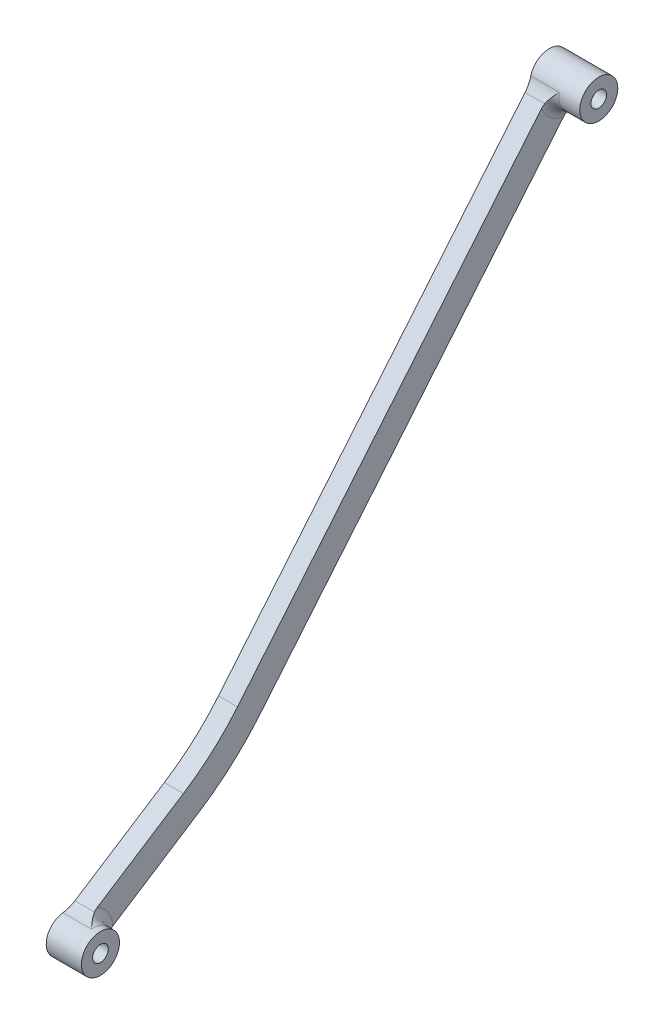
ISO-10303-21;
HEADER;
FILE_DESCRIPTION(('STEP AP214'),'2;1');
FILE_NAME('part.step','',(''),(''),'','','');
FILE_SCHEMA(('AUTOMOTIVE_DESIGN { 1 0 10303 214 1 1 1 1 }'));
ENDSEC;
DATA;
#1=APPLICATION_CONTEXT('core data for automotive mechanical design processes');
#2=APPLICATION_PROTOCOL_DEFINITION('international standard','automotive_design',2000,#1);
#3=PRODUCT_CONTEXT('',#1,'mechanical');
#4=PRODUCT('Part','Part','',(#3));
#5=PRODUCT_RELATED_PRODUCT_CATEGORY('part','',(#4));
#6=PRODUCT_DEFINITION_FORMATION('','',#4);
#7=PRODUCT_DEFINITION_CONTEXT('part definition',#1,'design');
#8=PRODUCT_DEFINITION('design','',#6,#7);
#9=PRODUCT_DEFINITION_SHAPE('','',#8);
#10=(LENGTH_UNIT() NAMED_UNIT(*) SI_UNIT(.MILLI.,.METRE.));
#11=(NAMED_UNIT(*) PLANE_ANGLE_UNIT() SI_UNIT($,.RADIAN.));
#12=(NAMED_UNIT(*) SI_UNIT($,.STERADIAN.) SOLID_ANGLE_UNIT());
#13=UNCERTAINTY_MEASURE_WITH_UNIT(LENGTH_MEASURE(1.E-05),#10,'distance_accuracy_value','');
#14=(GEOMETRIC_REPRESENTATION_CONTEXT(3) GLOBAL_UNCERTAINTY_ASSIGNED_CONTEXT((#13)) GLOBAL_UNIT_ASSIGNED_CONTEXT((#10,
#11,#12)) REPRESENTATION_CONTEXT('',''));
#15=CARTESIAN_POINT('',(0.,0.,0.));
#16=DIRECTION('',(0.,0.,1.));
#17=DIRECTION('',(1.,0.,0.));
#18=AXIS2_PLACEMENT_3D('',#15,#16,#17);
#19=CARTESIAN_POINT('',(-10.4,4.78302883585792,1.33314402376694));
#20=DIRECTION('',(1.,0.,0.));
#21=DIRECTION('',(0.,0.,-1.));
#22=AXIS2_PLACEMENT_3D('',#19,#20,#21);
#23=PLANE('',#22);
#24=DIRECTION('',(0.,0.769433939697813,-0.638726398735095));
#25=VECTOR('',#24,1.);
#26=CARTESIAN_POINT('',(-10.4,47.9582816977153,-107.288492562416));
#27=LINE('',#26,#25);
#28=CARTESIAN_POINT('',(-10.4,-30.9856494933073,-41.7551565993106));
#29=VERTEX_POINT('',#28);
#30=CARTESIAN_POINT('',(-10.4,45.9959165225748,-105.659484045047));
#31=VERTEX_POINT('',#30);
#32=EDGE_CURVE('E152',#29,#31,#27,.T.);
#33=ORIENTED_EDGE('',*,*,#32,.T.);
#34=CARTESIAN_POINT('',(-10.4,51.9101917486536,-106.670101950188));
#35=DIRECTION('',(1.,0.,0.));
#36=DIRECTION('',(0.,0.,-1.));
#37=AXIS2_PLACEMENT_3D('',#34,#35,#36);
#38=CIRCLE('',#37,6.);
#39=CARTESIAN_POINT('',(-10.4,49.8282749149854,-101.04288040686));
#40=VERTEX_POINT('',#39);
#41=EDGE_CURVE('E213',#31,#40,#38,.F.);
#42=ORIENTED_EDGE('',*,*,#41,.T.);
#43=DIRECTION('',(0.,-0.769433939697813,0.638726398735094));
#44=VECTOR('',#43,1.);
#45=CARTESIAN_POINT('',(-10.4,-27.1532911008968,-37.1385529611237));
#46=LINE('',#45,#44);
#47=CARTESIAN_POINT('',(-10.4,-27.1532911008968,-37.1385529611237));
#48=VERTEX_POINT('',#47);
#49=EDGE_CURVE('E150',#40,#48,#46,.T.);
#50=ORIENTED_EDGE('',*,*,#49,.T.);
#51=CARTESIAN_POINT('',(-10.4,4.78302883585792,1.33314402376694));
#52=DIRECTION('',(-1.,0.,0.));
#53=DIRECTION('',(0.,0.,-1.));
#54=AXIS2_PLACEMENT_3D('',#51,#52,#53);
#55=CIRCLE('',#54,50.);
#56=CARTESIAN_POINT('',(-10.4,-37.2377094525441,-25.7640431678519));
#57=VERTEX_POINT('',#56);
#58=EDGE_CURVE('E172',#48,#57,#55,.T.);
#59=ORIENTED_EDGE('',*,*,#58,.T.);
#60=DIRECTION('',(0.,-0.541943743832376,0.840414765768039));
#61=VECTOR('',#60,1.);
#62=CARTESIAN_POINT('',(-10.4,-50.2863804140003,-5.52892490242477));
#63=LINE('',#62,#61);
#64=CARTESIAN_POINT('',(-10.4,-48.9042064872828,-7.67231965527997));
#65=VERTEX_POINT('',#64);
#66=EDGE_CURVE('E128',#57,#65,#63,.T.);
#67=ORIENTED_EDGE('',*,*,#66,.T.);
#68=CARTESIAN_POINT('',(-10.4,-54.2414730820722,-4.93122766555308));
#69=DIRECTION('',(1.,0.,0.));
#70=DIRECTION('',(0.,0.,-1.));
#71=AXIS2_PLACEMENT_3D('',#68,#69,#70);
#72=CIRCLE('',#71,6.);
#73=CARTESIAN_POINT('',(-10.4,-53.946695081891,-10.9239821182742));
#74=VERTEX_POINT('',#73);
#75=EDGE_CURVE('E211',#65,#74,#72,.F.);
#76=ORIENTED_EDGE('',*,*,#75,.T.);
#77=DIRECTION('',(0.,0.541943743832377,-0.840414765768038));
#78=VECTOR('',#77,1.);
#79=CARTESIAN_POINT('',(-10.4,-55.3288690086085,-8.78058736541904));
#80=LINE('',#79,#78);
#81=CARTESIAN_POINT('',(-10.4,-42.2801980471522,-29.0157056308461));
#82=VERTEX_POINT('',#81);
#83=EDGE_CURVE('E175',#74,#82,#80,.T.);
#84=ORIENTED_EDGE('',*,*,#83,.T.);
#85=CARTESIAN_POINT('',(-10.4,4.78302883585792,1.33314402376694));
#86=DIRECTION('',(1.,0.,0.));
#87=DIRECTION('',(0.,0.,-1.));
#88=AXIS2_PLACEMENT_3D('',#85,#86,#87);
#89=CIRCLE('',#88,56.);
#90=EDGE_CURVE('E177',#82,#29,#89,.T.);
#91=ORIENTED_EDGE('',*,*,#90,.T.);
#92=EDGE_LOOP('',(#33,#42,#50,#59,#67,#76,#84,#91));
#93=FACE_BOUND('',#92,.T.);
#94=ADVANCED_FACE('F17',(#93),#23,.T.);
#95=CARTESIAN_POINT('',(-14.4,4.78302883585792,1.33314402376694));
#96=DIRECTION('',(1.,0.,0.));
#97=DIRECTION('',(0.,0.,-1.));
#98=AXIS2_PLACEMENT_3D('',#95,#96,#97);
#99=CYLINDRICAL_SURFACE('',#98,50.);
#100=ORIENTED_EDGE('',*,*,#58,.F.);
#101=DIRECTION('',(1.,0.,0.));
#102=VECTOR('',#101,1.);
#103=CARTESIAN_POINT('',(-14.4,-27.1532911008968,-37.1385529611237));
#104=LINE('',#103,#102);
#105=CARTESIAN_POINT('',(-14.4,-27.1532911008968,-37.1385529611237));
#106=VERTEX_POINT('',#105);
#107=EDGE_CURVE('E149',#106,#48,#104,.T.);
#108=ORIENTED_EDGE('',*,*,#107,.F.);
#109=CARTESIAN_POINT('',(-14.4,4.78302883585792,1.33314402376694));
#110=DIRECTION('',(-1.,0.,0.));
#111=DIRECTION('',(0.,0.,-1.));
#112=AXIS2_PLACEMENT_3D('',#109,#110,#111);
#113=CIRCLE('',#112,50.);
#114=CARTESIAN_POINT('',(-14.4,-37.2377094525441,-25.7640431678519));
#115=VERTEX_POINT('',#114);
#116=EDGE_CURVE('E140',#106,#115,#113,.T.);
#117=ORIENTED_EDGE('',*,*,#116,.T.);
#118=DIRECTION('',(1.,0.,0.));
#119=VECTOR('',#118,1.);
#120=CARTESIAN_POINT('',(-14.4,-37.2377094525441,-25.7640431678519));
#121=LINE('',#120,#119);
#122=EDGE_CURVE('E123',#115,#57,#121,.T.);
#123=ORIENTED_EDGE('',*,*,#122,.T.);
#124=EDGE_LOOP('',(#100,#108,#117,#123));
#125=FACE_BOUND('',#124,.T.);
#126=ADVANCED_FACE('F147',(#125),#99,.F.);
#127=CARTESIAN_POINT('',(-14.4,-27.1532911008968,-37.1385529611237));
#128=DIRECTION('',(0.,0.638726398735094,0.769433939697813));
#129=DIRECTION('',(0.,-0.769433939697813,0.638726398735094));
#130=AXIS2_PLACEMENT_3D('',#127,#128,#129);
#131=PLANE('',#130);
#132=ORIENTED_EDGE('',*,*,#49,.F.);
#133=CARTESIAN_POINT('',(-10.4,49.8282749149854,-101.04288040686));
#134=CARTESIAN_POINT('',(-10.4000018780008,49.8829783343423,-101.088291086376));
#135=CARTESIAN_POINT('',(-10.3971571203399,49.9376712152212,-101.133693017638));
#136=CARTESIAN_POINT('',(-10.3859981831861,50.0464152362978,-101.223964155136));
#137=CARTESIAN_POINT('',(-10.3777150882286,50.1004682567761,-101.268834922241));
#138=CARTESIAN_POINT('',(-10.3559028720338,50.2079189928066,-101.358032471407));
#139=CARTESIAN_POINT('',(-10.3423756939953,50.2613169435432,-101.4023594487));
#140=CARTESIAN_POINT('',(-10.3101728421491,50.3675077018207,-101.490511058753));
#141=CARTESIAN_POINT('',(-10.2914682778259,50.4202953291346,-101.534331391276));
#142=CARTESIAN_POINT('',(-10.2703025064278,50.4724861579859,-101.577656306437));
#143=B_SPLINE_CURVE_WITH_KNOTS('',3,(#133,#134,#135,#136,#137,#138,#139,#140,#141,#142),
.UNSPECIFIED.,.F.,.F.,(4,2,2,2,4),(0.,0.21321041686945,0.425212649260076,0.637136399038094,
0.850267417765537),.UNSPECIFIED.);
#144=CARTESIAN_POINT('',(-10.2703025064279,50.4724861579859,-101.577656306437));
#145=VERTEX_POINT('',#144);
#146=EDGE_CURVE('E256',#40,#145,#143,.T.);
#147=ORIENTED_EDGE('',*,*,#146,.T.);
#148=DIRECTION('',(-1.,0.,0.));
#149=VECTOR('',#148,1.);
#150=CARTESIAN_POINT('',(-14.4,50.4724861579859,-101.577656306437));
#151=LINE('',#150,#149);
#152=CARTESIAN_POINT('',(-14.4,50.4724861579858,-101.577656306437));
#153=VERTEX_POINT('',#152);
#154=EDGE_CURVE('E199',#145,#153,#151,.T.);
#155=ORIENTED_EDGE('',*,*,#154,.T.);
#156=DIRECTION('',(0.,-0.769433939697813,0.638726398735094));
#157=VECTOR('',#156,1.);
#158=CARTESIAN_POINT('',(-14.4,-27.1532911008968,-37.1385529611237));
#159=LINE('',#158,#157);
#160=EDGE_CURVE('E134',#153,#106,#159,.T.);
#161=ORIENTED_EDGE('',*,*,#160,.T.);
#162=ORIENTED_EDGE('',*,*,#107,.T.);
#163=EDGE_LOOP('',(#132,#147,#155,#161,#162));
#164=FACE_BOUND('',#163,.T.);
#165=ADVANCED_FACE('F284',(#164),#131,.T.);
#166=CARTESIAN_POINT('',(-14.4,51.9101917486536,-106.670101950188));
#167=DIRECTION('',(1.,0.,0.));
#168=DIRECTION('',(0.,0.,-1.));
#169=AXIS2_PLACEMENT_3D('',#166,#167,#168);
#170=CYLINDRICAL_SURFACE('',#169,4.);
#171=CARTESIAN_POINT('',(-8.4,51.9101917486536,-106.670101950188));
#172=DIRECTION('',(1.,0.,0.));
#173=DIRECTION('',(0.,0.,-1.));
#174=AXIS2_PLACEMENT_3D('',#171,#172,#173);
#175=CIRCLE('',#174,4.);
#176=CARTESIAN_POINT('',(-8.4,52.8680528693507,-102.786482237413));
#177=VERTEX_POINT('',#176);
#178=CARTESIAN_POINT('',(-8.4,48.269222798458,-108.326406603237));
#179=VERTEX_POINT('',#178);
#180=EDGE_CURVE('E208',#177,#179,#175,.T.);
#181=ORIENTED_EDGE('',*,*,#180,.T.);
#182=DIRECTION('',(1.,0.,0.));
#183=VECTOR('',#182,1.);
#184=CARTESIAN_POINT('',(-14.4,48.269222798458,-108.326406603237));
#185=LINE('',#184,#183);
#186=CARTESIAN_POINT('',(-14.4,48.269222798458,-108.326406603237));
#187=VERTEX_POINT('',#186);
#188=EDGE_CURVE('E197',#179,#187,#185,.F.);
#189=ORIENTED_EDGE('',*,*,#188,.T.);
#190=CARTESIAN_POINT('',(-14.4,51.9101917486536,-106.670101950188));
#191=DIRECTION('',(1.,0.,0.));
#192=DIRECTION('',(0.,0.,1.));
#193=AXIS2_PLACEMENT_3D('',#190,#191,#192);
#194=CIRCLE('',#193,4.);
#195=CARTESIAN_POINT('',(-14.4,52.8680528693507,-102.786482237413));
#196=VERTEX_POINT('',#195);
#197=EDGE_CURVE('E168',#187,#196,#194,.T.);
#198=ORIENTED_EDGE('',*,*,#197,.T.);
#199=DIRECTION('',(1.,0.,0.));
#200=VECTOR('',#199,1.);
#201=CARTESIAN_POINT('',(-14.4,52.8680528693507,-102.786482237413));
#202=LINE('',#201,#200);
#203=EDGE_CURVE('E195',#196,#177,#202,.T.);
#204=ORIENTED_EDGE('',*,*,#203,.T.);
#205=EDGE_LOOP('',(#181,#189,#198,#204));
#206=FACE_BOUND('',#205,.T.);
#207=CARTESIAN_POINT('',(-4.,51.9101917486536,-106.670101950188));
#208=DIRECTION('',(-1.,0.,0.));
#209=DIRECTION('',(0.,0.,1.));
#210=AXIS2_PLACEMENT_3D('',#207,#208,#209);
#211=CIRCLE('',#210,4.);
#212=CARTESIAN_POINT('',(-4.,51.9101917486536,-102.670101950188));
#213=VERTEX_POINT('',#212);
#214=EDGE_CURVE('E434',#213,#213,#211,.T.);
#215=ORIENTED_EDGE('',*,*,#214,.T.);
#216=EDGE_LOOP('',(#215));
#217=FACE_BOUND('',#216,.T.);
#218=ADVANCED_FACE('F310',(#206,#217),#170,.T.);
#219=CARTESIAN_POINT('',(-14.4,47.9582816977153,-107.288492562416));
#220=DIRECTION('',(0.,-0.638726398735095,-0.769433939697813));
#221=DIRECTION('',(0.,0.769433939697813,-0.638726398735095));
#222=AXIS2_PLACEMENT_3D('',#219,#220,#221);
#223=PLANE('',#222);
#224=DIRECTION('',(0.,0.769433939697813,-0.638726398735095));
#225=VECTOR('',#224,1.);
#226=CARTESIAN_POINT('',(-14.4,47.9582816977153,-107.288492562416));
#227=LINE('',#226,#225);
#228=CARTESIAN_POINT('',(-14.4,-30.9856494933073,-41.7551565993106));
#229=VERTEX_POINT('',#228);
#230=CARTESIAN_POINT('',(-14.4,46.6401277655752,-106.194259944624));
#231=VERTEX_POINT('',#230);
#232=EDGE_CURVE('E165',#229,#231,#227,.T.);
#233=ORIENTED_EDGE('',*,*,#232,.T.);
#234=DIRECTION('',(-1.,0.,0.));
#235=VECTOR('',#234,1.);
#236=CARTESIAN_POINT('',(-10.4,46.6401277655752,-106.194259944624));
#237=LINE('',#236,#235);
#238=CARTESIAN_POINT('',(-10.2703025064279,46.6401277655752,-106.194259944624));
#239=VERTEX_POINT('',#238);
#240=EDGE_CURVE('E193',#231,#239,#237,.F.);
#241=ORIENTED_EDGE('',*,*,#240,.T.);
#242=CARTESIAN_POINT('',(-10.2703025064279,46.6401277655752,-106.194259944624));
#243=CARTESIAN_POINT('',(-10.291468277826,46.587936936724,-106.150935029463));
#244=CARTESIAN_POINT('',(-10.3101728421491,46.5351493094102,-106.10711469694));
#245=CARTESIAN_POINT('',(-10.3423756939953,46.4289585511326,-106.018963086887));
#246=CARTESIAN_POINT('',(-10.3559028720337,46.3755606003961,-105.974636109594));
#247=CARTESIAN_POINT('',(-10.3777150882286,46.2681098643656,-105.885438560428));
#248=CARTESIAN_POINT('',(-10.3859981831861,46.2140568438873,-105.840567793323));
#249=CARTESIAN_POINT('',(-10.3971571203398,46.1053128228107,-105.750296655825));
#250=CARTESIAN_POINT('',(-10.4000018780008,46.0506199419317,-105.704894724563));
#251=CARTESIAN_POINT('',(-10.4,45.9959165225748,-105.659484045047));
#252=B_SPLINE_CURVE_WITH_KNOTS('',3,(#242,#243,#244,#245,#246,#247,#248,#249,#250,#251),
.UNSPECIFIED.,.F.,.F.,(4,2,2,2,4),(0.,0.213131018727416,0.425054768505391,0.637057000896003,
0.850267417765426),.UNSPECIFIED.);
#253=EDGE_CURVE('E226',#239,#31,#252,.T.);
#254=ORIENTED_EDGE('',*,*,#253,.T.);
#255=ORIENTED_EDGE('',*,*,#32,.F.);
#256=DIRECTION('',(1.,0.,0.));
#257=VECTOR('',#256,1.);
#258=CARTESIAN_POINT('',(-14.4,-30.9856494933073,-41.7551565993106));
#259=LINE('',#258,#257);
#260=EDGE_CURVE('E184',#229,#29,#259,.T.);
#261=ORIENTED_EDGE('',*,*,#260,.F.);
#262=EDGE_LOOP('',(#233,#241,#254,#255,#261));
#263=FACE_BOUND('',#262,.T.);
#264=ADVANCED_FACE('F313',(#263),#223,.T.);
#265=CARTESIAN_POINT('',(-14.4,4.78302883585792,1.33314402376694));
#266=DIRECTION('',(1.,0.,0.));
#267=DIRECTION('',(0.,0.,-1.));
#268=AXIS2_PLACEMENT_3D('',#265,#266,#267);
#269=CYLINDRICAL_SURFACE('',#268,56.);
#270=ORIENTED_EDGE('',*,*,#90,.F.);
#271=DIRECTION('',(1.,0.,0.));
#272=VECTOR('',#271,1.);
#273=CARTESIAN_POINT('',(-14.4,-42.2801980471522,-29.0157056308461));
#274=LINE('',#273,#272);
#275=CARTESIAN_POINT('',(-14.4,-42.2801980471522,-29.0157056308461));
#276=VERTEX_POINT('',#275);
#277=EDGE_CURVE('E133',#276,#82,#274,.T.);
#278=ORIENTED_EDGE('',*,*,#277,.F.);
#279=CARTESIAN_POINT('',(-14.4,4.78302883585792,1.33314402376694));
#280=DIRECTION('',(1.,0.,0.));
#281=DIRECTION('',(0.,0.,-1.));
#282=AXIS2_PLACEMENT_3D('',#279,#280,#281);
#283=CIRCLE('',#282,56.);
#284=EDGE_CURVE('E162',#276,#229,#283,.T.);
#285=ORIENTED_EDGE('',*,*,#284,.T.);
#286=ORIENTED_EDGE('',*,*,#260,.T.);
#287=EDGE_LOOP('',(#270,#278,#285,#286));
#288=FACE_BOUND('',#287,.T.);
#289=ADVANCED_FACE('F318',(#288),#269,.T.);
#290=CARTESIAN_POINT('',(-14.4,-55.3288690086085,-8.78058736541904));
#291=DIRECTION('',(0.,-0.840414765768038,-0.541943743832377));
#292=DIRECTION('',(0.,0.541943743832377,-0.840414765768039));
#293=AXIS2_PLACEMENT_3D('',#290,#291,#292);
#294=PLANE('',#293);
#295=ORIENTED_EDGE('',*,*,#83,.F.);
#296=CARTESIAN_POINT('',(-10.4,-53.946695081891,-10.9239821182742));
#297=CARTESIAN_POINT('',(-10.4000018780008,-53.9852249339772,-10.8642322697251));
#298=CARTESIAN_POINT('',(-10.3971571203398,-54.0237473633831,-10.8044939318359));
#299=CARTESIAN_POINT('',(-10.3859981831861,-54.1003402180274,-10.6857181977714));
#300=CARTESIAN_POINT('',(-10.3777150882286,-54.1384119676241,-10.6266787478582));
#301=CARTESIAN_POINT('',(-10.3559028720338,-54.2140939087987,-10.5093156053016));
#302=CARTESIAN_POINT('',(-10.3423756939953,-54.2517042660264,-10.4509916557779));
#303=CARTESIAN_POINT('',(-10.3101728421491,-54.3264987534179,-10.3350047248146));
#304=CARTESIAN_POINT('',(-10.2914682778259,-54.3636792349363,-10.2773474014817));
#305=CARTESIAN_POINT('',(-10.2703025064278,-54.4004393669269,-10.2203419316925));
#306=B_SPLINE_CURVE_WITH_KNOTS('',3,(#296,#297,#298,#299,#300,#301,#302,#303,#304,#305),
.UNSPECIFIED.,.F.,.F.,(4,2,2,2,4),(0.,0.213210416869413,0.425212649260006,0.637136399037972,
0.850267417765388),.UNSPECIFIED.);
#307=CARTESIAN_POINT('',(-10.270302506428,-54.4004393669269,-10.2203419316925));
#308=VERTEX_POINT('',#307);
#309=EDGE_CURVE('E31',#74,#308,#306,.T.);
#310=ORIENTED_EDGE('',*,*,#309,.T.);
#311=DIRECTION('',(-1.,0.,0.));
#312=VECTOR('',#311,1.);
#313=CARTESIAN_POINT('',(-14.4,-54.4004393669269,-10.2203419316925));
#314=LINE('',#313,#312);
#315=CARTESIAN_POINT('',(-14.4,-54.4004393669269,-10.2203419316925));
#316=VERTEX_POINT('',#315);
#317=EDGE_CURVE('E37',#308,#316,#314,.T.);
#318=ORIENTED_EDGE('',*,*,#317,.T.);
#319=DIRECTION('',(0.,0.541943743832377,-0.840414765768038));
#320=VECTOR('',#319,1.);
#321=CARTESIAN_POINT('',(-14.4,-55.3288690086085,-8.78058736541904));
#322=LINE('',#321,#320);
#323=EDGE_CURVE('E160',#316,#276,#322,.T.);
#324=ORIENTED_EDGE('',*,*,#323,.T.);
#325=ORIENTED_EDGE('',*,*,#277,.T.);
#326=EDGE_LOOP('',(#295,#310,#318,#324,#325));
#327=FACE_BOUND('',#326,.T.);
#328=ADVANCED_FACE('F321',(#327),#294,.T.);
#329=CARTESIAN_POINT('',(-14.4,-54.2414730820722,-4.93122766555308));
#330=DIRECTION('',(1.,0.,0.));
#331=DIRECTION('',(0.,0.,-1.));
#332=AXIS2_PLACEMENT_3D('',#329,#330,#331);
#333=CYLINDRICAL_SURFACE('',#332,4.);
#334=CARTESIAN_POINT('',(-8.4,-54.2414730820722,-4.93122766555308));
#335=DIRECTION('',(1.,0.,0.));
#336=DIRECTION('',(0.,0.,-1.));
#337=AXIS2_PLACEMENT_3D('',#334,#335,#336);
#338=CIRCLE('',#337,4.);
#339=CARTESIAN_POINT('',(-8.4,-56.3220550338574,-8.34753835720655));
#340=VERTEX_POINT('',#339);
#341=CARTESIAN_POINT('',(-8.4,-50.2710687203275,-4.44554340161343));
#342=VERTEX_POINT('',#341);
#343=EDGE_CURVE('E215',#340,#342,#338,.T.);
#344=ORIENTED_EDGE('',*,*,#343,.T.);
#345=DIRECTION('',(1.,0.,0.));
#346=VECTOR('',#345,1.);
#347=CARTESIAN_POINT('',(-14.4,-50.2710687203275,-4.44554340161343));
#348=LINE('',#347,#346);
#349=CARTESIAN_POINT('',(-14.4,-50.2710687203275,-4.44554340161343));
#350=VERTEX_POINT('',#349);
#351=EDGE_CURVE('E183',#342,#350,#348,.F.);
#352=ORIENTED_EDGE('',*,*,#351,.T.);
#353=CARTESIAN_POINT('',(-14.4,-54.2414730820722,-4.93122766555308));
#354=DIRECTION('',(1.,0.,0.));
#355=DIRECTION('',(0.,0.,-1.));
#356=AXIS2_PLACEMENT_3D('',#353,#354,#355);
#357=CIRCLE('',#356,4.);
#358=CARTESIAN_POINT('',(-14.4,-56.3220550338574,-8.34753835720655));
#359=VERTEX_POINT('',#358);
#360=EDGE_CURVE('E144',#350,#359,#357,.T.);
#361=ORIENTED_EDGE('',*,*,#360,.T.);
#362=DIRECTION('',(1.,0.,0.));
#363=VECTOR('',#362,1.);
#364=CARTESIAN_POINT('',(-14.4,-56.3220550338574,-8.34753835720655));
#365=LINE('',#364,#363);
#366=EDGE_CURVE('E189',#359,#340,#365,.T.);
#367=ORIENTED_EDGE('',*,*,#366,.T.);
#368=EDGE_LOOP('',(#344,#352,#361,#367));
#369=FACE_BOUND('',#368,.T.);
#370=CARTESIAN_POINT('',(-7.,-54.2414730820722,-4.93122766555308));
#371=DIRECTION('',(1.,0.,0.));
#372=DIRECTION('',(0.,0.,-1.));
#373=AXIS2_PLACEMENT_3D('',#370,#371,#372);
#374=CIRCLE('',#373,4.);
#375=CARTESIAN_POINT('',(-7.,-54.2414730820722,-8.93122766555308));
#376=VERTEX_POINT('',#375);
#377=EDGE_CURVE('E427',#376,#376,#374,.T.);
#378=ORIENTED_EDGE('',*,*,#377,.F.);
#379=EDGE_LOOP('',(#378));
#380=FACE_BOUND('',#379,.T.);
#381=ADVANCED_FACE('F282',(#369,#380),#333,.T.);
#382=CARTESIAN_POINT('',(-14.4,-50.2863804140003,-5.52892490242477));
#383=DIRECTION('',(0.,0.840414765768039,0.541943743832376));
#384=DIRECTION('',(0.,-0.541943743832376,0.840414765768039));
#385=AXIS2_PLACEMENT_3D('',#382,#383,#384);
#386=PLANE('',#385);
#387=DIRECTION('',(0.,-0.541943743832376,0.840414765768039));
#388=VECTOR('',#387,1.);
#389=CARTESIAN_POINT('',(-14.4,-50.2863804140003,-5.52892490242477));
#390=LINE('',#389,#388);
#391=CARTESIAN_POINT('',(-14.4,-49.3579507723186,-6.96867946869823));
#392=VERTEX_POINT('',#391);
#393=EDGE_CURVE('E126',#115,#392,#390,.T.);
#394=ORIENTED_EDGE('',*,*,#393,.T.);
#395=DIRECTION('',(-1.,0.,0.));
#396=VECTOR('',#395,1.);
#397=CARTESIAN_POINT('',(-10.4,-49.3579507723186,-6.96867946869823));
#398=LINE('',#397,#396);
#399=CARTESIAN_POINT('',(-10.270302506428,-49.3579507723186,-6.96867946869823));
#400=VERTEX_POINT('',#399);
#401=EDGE_CURVE('E45',#392,#400,#398,.F.);
#402=ORIENTED_EDGE('',*,*,#401,.T.);
#403=CARTESIAN_POINT('',(-10.270302506428,-49.3579507723186,-6.96867946869823));
#404=CARTESIAN_POINT('',(-10.291468277826,-49.321190640328,-7.02568493848745));
#405=CARTESIAN_POINT('',(-10.3101728421492,-49.2840101588097,-7.08334226182033));
#406=CARTESIAN_POINT('',(-10.3423756939953,-49.2092156714182,-7.19932919278367));
#407=CARTESIAN_POINT('',(-10.3559028720338,-49.1716053141905,-7.25765314230734));
#408=CARTESIAN_POINT('',(-10.3777150882286,-49.0959233730159,-7.37501628486399));
#409=CARTESIAN_POINT('',(-10.3859981831861,-49.0578516234192,-7.43405573477711));
#410=CARTESIAN_POINT('',(-10.3971571203398,-48.9812587687749,-7.55283146884165));
#411=CARTESIAN_POINT('',(-10.4000018780008,-48.942736339369,-7.61256980673081));
#412=CARTESIAN_POINT('',(-10.4,-48.9042064872828,-7.67231965527997));
#413=B_SPLINE_CURVE_WITH_KNOTS('',3,(#403,#404,#405,#406,#407,#408,#409,#410,#411,#412),
.UNSPECIFIED.,.F.,.F.,(4,2,2,2,4),(0.,0.213131018727388,0.425054768505328,0.637057000895904,
0.850267417765299),.UNSPECIFIED.);
#414=EDGE_CURVE('E267',#400,#65,#413,.T.);
#415=ORIENTED_EDGE('',*,*,#414,.T.);
#416=ORIENTED_EDGE('',*,*,#66,.F.);
#417=ORIENTED_EDGE('',*,*,#122,.F.);
#418=EDGE_LOOP('',(#394,#402,#415,#416,#417));
#419=FACE_BOUND('',#418,.T.);
#420=ADVANCED_FACE('F125',(#419),#386,.T.);
#421=CARTESIAN_POINT('',(-14.4,4.78302883585792,1.33314402376694));
#422=DIRECTION('',(1.,0.,0.));
#423=DIRECTION('',(0.,0.,-1.));
#424=AXIS2_PLACEMENT_3D('',#421,#422,#423);
#425=PLANE('',#424);
#426=CARTESIAN_POINT('',(-14.4,51.9101917486536,-106.670101950188));
#427=DIRECTION('',(1.,0.,0.));
#428=DIRECTION('',(0.,0.,-1.));
#429=AXIS2_PLACEMENT_3D('',#426,#427,#428);
#430=CIRCLE('',#429,1.65);
#431=CARTESIAN_POINT('',(-14.4,51.9101917486536,-108.320101950188));
#432=VERTEX_POINT('',#431);
#433=EDGE_CURVE('E431',#432,#432,#430,.T.);
#434=ORIENTED_EDGE('',*,*,#433,.T.);
#435=EDGE_LOOP('',(#434));
#436=FACE_BOUND('',#435,.T.);
#437=CARTESIAN_POINT('',(-14.4,-54.2414730820722,-4.93122766555308));
#438=DIRECTION('',(1.,0.,0.));
#439=DIRECTION('',(0.,0.,-1.));
#440=AXIS2_PLACEMENT_3D('',#437,#438,#439);
#441=CIRCLE('',#440,1.65);
#442=CARTESIAN_POINT('',(-14.4,-54.2414730820722,-6.58122766555308));
#443=VERTEX_POINT('',#442);
#444=EDGE_CURVE('E155',#443,#443,#441,.T.);
#445=ORIENTED_EDGE('',*,*,#444,.T.);
#446=EDGE_LOOP('',(#445));
#447=FACE_BOUND('',#446,.T.);
#448=ORIENTED_EDGE('',*,*,#116,.F.);
#449=ORIENTED_EDGE('',*,*,#160,.F.);
#450=CARTESIAN_POINT('',(-14.4,54.3048445503964,-96.9610526682497));
#451=DIRECTION('',(1.,0.,0.));
#452=DIRECTION('',(0.,0.,-1.));
#453=AXIS2_PLACEMENT_3D('',#450,#451,#452);
#454=CIRCLE('',#453,6.);
#455=EDGE_CURVE('E206',#153,#196,#454,.T.);
#456=ORIENTED_EDGE('',*,*,#455,.T.);
#457=ORIENTED_EDGE('',*,*,#197,.F.);
#458=CARTESIAN_POINT('',(-14.4,42.8077693731646,-110.81086358281));
#459=DIRECTION('',(1.,0.,0.));
#460=DIRECTION('',(0.,0.,-1.));
#461=AXIS2_PLACEMENT_3D('',#458,#459,#460);
#462=CIRCLE('',#461,6.);
#463=EDGE_CURVE('E204',#187,#231,#462,.T.);
#464=ORIENTED_EDGE('',*,*,#463,.T.);
#465=ORIENTED_EDGE('',*,*,#232,.F.);
#466=ORIENTED_EDGE('',*,*,#284,.F.);
#467=ORIENTED_EDGE('',*,*,#323,.F.);
#468=CARTESIAN_POINT('',(-14.4,-59.4429279615351,-13.4720043946867));
#469=DIRECTION('',(1.,0.,0.));
#470=DIRECTION('',(0.,0.,-1.));
#471=AXIS2_PLACEMENT_3D('',#468,#469,#470);
#472=CIRCLE('',#471,6.);
#473=EDGE_CURVE('E201',#316,#359,#472,.T.);
#474=ORIENTED_EDGE('',*,*,#473,.T.);
#475=ORIENTED_EDGE('',*,*,#360,.F.);
#476=CARTESIAN_POINT('',(-14.4,-44.3154621777104,-3.71701700570397));
#477=DIRECTION('',(1.,0.,0.));
#478=DIRECTION('',(0.,0.,-1.));
#479=AXIS2_PLACEMENT_3D('',#476,#477,#478);
#480=CIRCLE('',#479,6.);
#481=EDGE_CURVE('E143',#350,#392,#480,.T.);
#482=ORIENTED_EDGE('',*,*,#481,.T.);
#483=ORIENTED_EDGE('',*,*,#393,.F.);
#484=EDGE_LOOP('',(#448,#449,#456,#457,#464,#465,#466,#467,#474,#475,#482,#483));
#485=FACE_BOUND('',#484,.T.);
#486=ADVANCED_FACE('F138',(#436,#447,#485),#425,.F.);
#487=CARTESIAN_POINT('',(-14.4,-54.2414730820722,-4.93122766555308));
#488=DIRECTION('',(1.,0.,0.));
#489=DIRECTION('',(0.,0.,-1.));
#490=AXIS2_PLACEMENT_3D('',#487,#488,#489);
#491=CYLINDRICAL_SURFACE('',#490,1.65);
#492=ORIENTED_EDGE('',*,*,#444,.F.);
#493=EDGE_LOOP('',(#492));
#494=FACE_BOUND('',#493,.T.);
#495=CARTESIAN_POINT('',(-7.,-54.2414730820722,-4.93122766555308));
#496=DIRECTION('',(1.,0.,0.));
#497=DIRECTION('',(0.,0.,-1.));
#498=AXIS2_PLACEMENT_3D('',#495,#496,#497);
#499=CIRCLE('',#498,1.65);
#500=CARTESIAN_POINT('',(-7.,-54.2414730820722,-6.58122766555308));
#501=VERTEX_POINT('',#500);
#502=EDGE_CURVE('E426',#501,#501,#499,.T.);
#503=ORIENTED_EDGE('',*,*,#502,.T.);
#504=EDGE_LOOP('',(#503));
#505=FACE_BOUND('',#504,.T.);
#506=ADVANCED_FACE('F387',(#494,#505),#491,.F.);
#507=CARTESIAN_POINT('',(-14.4,51.9101917486536,-106.670101950188));
#508=DIRECTION('',(1.,0.,0.));
#509=DIRECTION('',(0.,0.,-1.));
#510=AXIS2_PLACEMENT_3D('',#507,#508,#509);
#511=CYLINDRICAL_SURFACE('',#510,1.65);
#512=ORIENTED_EDGE('',*,*,#433,.F.);
#513=EDGE_LOOP('',(#512));
#514=FACE_BOUND('',#513,.T.);
#515=CARTESIAN_POINT('',(-4.,51.9101917486536,-106.670101950188));
#516=DIRECTION('',(1.,0.,0.));
#517=DIRECTION('',(0.,0.,-1.));
#518=AXIS2_PLACEMENT_3D('',#515,#516,#517);
#519=CIRCLE('',#518,1.65);
#520=CARTESIAN_POINT('',(-4.,51.9101917486536,-108.320101950188));
#521=VERTEX_POINT('',#520);
#522=EDGE_CURVE('E428',#521,#521,#519,.T.);
#523=ORIENTED_EDGE('',*,*,#522,.T.);
#524=EDGE_LOOP('',(#523));
#525=FACE_BOUND('',#524,.T.);
#526=ADVANCED_FACE('F395',(#514,#525),#511,.F.);
#527=CARTESIAN_POINT('',(-7.,-43.,5.));
#528=DIRECTION('',(1.,0.,0.));
#529=DIRECTION('',(0.,0.,-1.));
#530=AXIS2_PLACEMENT_3D('',#527,#528,#529);
#531=PLANE('',#530);
#532=ORIENTED_EDGE('',*,*,#502,.F.);
#533=EDGE_LOOP('',(#532));
#534=FACE_BOUND('',#533,.T.);
#535=ORIENTED_EDGE('',*,*,#377,.T.);
#536=EDGE_LOOP('',(#535));
#537=FACE_BOUND('',#536,.T.);
#538=ADVANCED_FACE('F296',(#534,#537),#531,.T.);
#539=CARTESIAN_POINT('',(-4.,-33.7106781186548,-105.857864376269));
#540=DIRECTION('',(-1.,0.,0.));
#541=DIRECTION('',(0.,0.,1.));
#542=AXIS2_PLACEMENT_3D('',#539,#540,#541);
#543=PLANE('',#542);
#544=ORIENTED_EDGE('',*,*,#522,.F.);
#545=EDGE_LOOP('',(#544));
#546=FACE_BOUND('',#545,.T.);
#547=ORIENTED_EDGE('',*,*,#214,.F.);
#548=EDGE_LOOP('',(#547));
#549=FACE_BOUND('',#548,.T.);
#550=ADVANCED_FACE('F288',(#546,#549),#543,.F.);
#551=CARTESIAN_POINT('',(-14.4,-59.4429279615351,-13.4720043946867));
#552=DIRECTION('',(1.,0.,0.));
#553=DIRECTION('',(0.,0.,-1.));
#554=AXIS2_PLACEMENT_3D('',#551,#552,#553);
#555=CYLINDRICAL_SURFACE('',#554,6.);
#556=ORIENTED_EDGE('',*,*,#473,.F.);
#557=ORIENTED_EDGE('',*,*,#317,.F.);
#558=CARTESIAN_POINT('',(-10.270302506428,-54.4004393669269,-10.2203419316925));
#559=CARTESIAN_POINT('',(-10.2449383728317,-54.4444807963876,-10.1520427145943));
#560=CARTESIAN_POINT('',(-10.216394105505,-54.4893270846059,-10.0855459125645));
#561=CARTESIAN_POINT('',(-10.1538156294526,-54.5802467065481,-9.9562454689994));
#562=CARTESIAN_POINT('',(-10.119790637336,-54.6263178737242,-9.89343586473136));
#563=CARTESIAN_POINT('',(-10.0113506330571,-54.7651258689712,-9.71151152166155));
#564=CARTESIAN_POINT('',(-9.930051530728,-54.8593142446996,-9.59759222111216));
#565=CARTESIAN_POINT('',(-9.7544301850222,-55.0499092610706,-9.38274464862905));
#566=CARTESIAN_POINT('',(-9.66010814092234,-55.1463158677511,-9.28181617795554));
#567=CARTESIAN_POINT('',(-9.46237272448335,-55.340938740736,-9.09110773441779));
#568=CARTESIAN_POINT('',(-9.35895121434406,-55.4391565635131,-9.00133791760285));
#569=CARTESIAN_POINT('',(-9.14573629327619,-55.6378947994146,-8.8309985909263));
#570=CARTESIAN_POINT('',(-9.03591479301669,-55.7384239734484,-8.75047509965326));
#571=CARTESIAN_POINT('',(-8.81296024743935,-55.9418904271339,-8.59769233168788));
#572=CARTESIAN_POINT('',(-8.6998287091393,-56.044826606749,-8.52542936541591));
#573=CARTESIAN_POINT('',(-8.52639642640112,-56.2044340803923,-8.4206216335615));
#574=CARTESIAN_POINT('',(-8.46650358522845,-56.2598776930488,-8.38550299930463));
#575=CARTESIAN_POINT('',(-8.40440385488716,-56.3179355655083,-8.35004887563269));
#576=CARTESIAN_POINT('',(-8.40220192706015,-56.319994922056,-8.34879299516026));
#577=CARTESIAN_POINT('',(-8.4,-56.3220550338574,-8.34753835720655));
#578=B_SPLINE_CURVE_WITH_KNOTS('',3,(#558,#559,#560,#561,#562,#563,#564,#565,#566,#567,#568,
#569,#570,#571,#572,#573,#574,#575,#576,#577),.UNSPECIFIED.,.F.,.F.,(4,2,2,2,2,2,2,2,2,4),(0.,
0.255191688267771,0.509958631992391,1.01459583261576,1.51922531214526,2.02431076860623,
2.53181003263437,3.03908172803999,3.30561095653229,3.31540891647558),.UNSPECIFIED.);
#579=EDGE_CURVE('E11',#308,#340,#578,.T.);
#580=ORIENTED_EDGE('',*,*,#579,.T.);
#581=ORIENTED_EDGE('',*,*,#366,.F.);
#582=EDGE_LOOP('',(#556,#557,#580,#581));
#583=FACE_BOUND('',#582,.T.);
#584=ADVANCED_FACE('F285',(#583),#555,.F.);
#585=CARTESIAN_POINT('',(-14.4,-44.3154621777104,-3.71701700570397));
#586=DIRECTION('',(1.,0.,0.));
#587=DIRECTION('',(0.,0.,-1.));
#588=AXIS2_PLACEMENT_3D('',#585,#586,#587);
#589=CYLINDRICAL_SURFACE('',#588,6.);
#590=ORIENTED_EDGE('',*,*,#481,.F.);
#591=ORIENTED_EDGE('',*,*,#351,.F.);
#592=CARTESIAN_POINT('',(-10.270302506428,-49.3579507723186,-6.96867946869823));
#593=CARTESIAN_POINT('',(-10.2449383728317,-49.4019943293577,-6.90038162357478));
#594=CARTESIAN_POINT('',(-10.216394105505,-49.4440639595267,-6.83209428606194));
#595=CARTESIAN_POINT('',(-10.1538156294526,-49.524332792831,-6.69592565252164));
#596=CARTESIAN_POINT('',(-10.119790637336,-49.5625383214138,-6.62804386984775));
#597=CARTESIAN_POINT('',(-10.0113506330571,-49.6709846032793,-6.42654069345733));
#598=CARTESIAN_POINT('',(-9.93005153072799,-49.7358938538796,-6.29374066956229));
#599=CARTESIAN_POINT('',(-9.7544301850222,-49.8529633889125,-6.03147999078153));
#600=CARTESIAN_POINT('',(-9.66010814092238,-49.9051238683927,-5.90201928483359));
#601=CARTESIAN_POINT('',(-9.46237272448336,-49.9985428382993,-5.64604922957898));
#602=CARTESIAN_POINT('',(-9.35895121434403,-50.0397914352362,-5.51954265278237));
#603=CARTESIAN_POINT('',(-9.14573629327628,-50.1129578961872,-5.2682280260416));
#604=CARTESIAN_POINT('',(-9.03591479301696,-50.1448302264782,-5.14343098264487));
#605=CARTESIAN_POINT('',(-8.81296024743926,-50.2000533198045,-4.89505308120072));
#606=CARTESIAN_POINT('',(-8.69982870913868,-50.2234078976019,-4.77147170289486));
#607=CARTESIAN_POINT('',(-8.52639642640145,-50.2530257586817,-4.58283981639468));
#608=CARTESIAN_POINT('',(-8.46650358522943,-50.2621401515898,-4.51784565897675));
#609=CARTESIAN_POINT('',(-8.40440385488721,-50.2704815190592,-4.4503317120583));
#610=CARTESIAN_POINT('',(-8.40220192706017,-50.2707758414144,-4.44793764449402));
#611=CARTESIAN_POINT('',(-8.4,-50.2710687203275,-4.44554340161343));
#612=B_SPLINE_CURVE_WITH_KNOTS('',3,(#592,#593,#594,#595,#596,#597,#598,#599,#600,#601,#602,
#603,#604,#605,#606,#607,#608,#609,#610,#611),.UNSPECIFIED.,.F.,.F.,(4,2,2,2,2,2,2,2,2,4),(0.,
0.255191688267799,0.509958631992435,1.01459583261579,1.51922531214531,2.02431076860631,
2.53181003263444,3.03908172803999,3.30561095653234,3.31540891647558),.UNSPECIFIED.);
#613=EDGE_CURVE('E255',#342,#400,#612,.F.);
#614=ORIENTED_EDGE('',*,*,#613,.T.);
#615=ORIENTED_EDGE('',*,*,#401,.F.);
#616=EDGE_LOOP('',(#590,#591,#614,#615));
#617=FACE_BOUND('',#616,.T.);
#618=ADVANCED_FACE('F241',(#617),#589,.F.);
#619=CARTESIAN_POINT('',(-14.4,42.8077693731646,-110.81086358281));
#620=DIRECTION('',(1.,0.,0.));
#621=DIRECTION('',(0.,0.,-1.));
#622=AXIS2_PLACEMENT_3D('',#619,#620,#621);
#623=CYLINDRICAL_SURFACE('',#622,6.);
#624=ORIENTED_EDGE('',*,*,#463,.F.);
#625=ORIENTED_EDGE('',*,*,#188,.F.);
#626=CARTESIAN_POINT('',(-10.2703025064279,46.6401277655752,-106.194259944624));
#627=CARTESIAN_POINT('',(-10.2449383728317,46.702658660413,-106.246166762634));
#628=CARTESIAN_POINT('',(-10.216394105505,46.7633036959673,-106.298656703668));
#629=CARTESIAN_POINT('',(-10.1538156294526,46.8807802004491,-106.404412333565));
#630=CARTESIAN_POINT('',(-10.1197906373361,46.9376178487259,-106.457676585851));
#631=CARTESIAN_POINT('',(-10.0113506330572,47.1016019493547,-106.617280285329));
#632=CARTESIAN_POINT('',(-9.93005153072805,47.2034164810756,-106.724438384838));
#633=CARTESIAN_POINT('',(-9.75443018502216,47.3938823251814,-106.93940047893));
#634=CARTESIAN_POINT('',(-9.66010814092227,47.4825338389436,-107.047204463606));
#635=CARTESIAN_POINT('',(-9.4623727244833,47.6485518599966,-107.263273410498));
#636=CARTESIAN_POINT('',(-9.35895121434408,47.7259080979143,-107.37153870123));
#637=CARTESIAN_POINT('',(-9.14573629327596,47.8712106704761,-107.589253043956));
#638=CARTESIAN_POINT('',(-9.03591479301616,47.9391102683817,-107.698705280493));
#639=CARTESIAN_POINT('',(-8.81296024743973,48.0664162697356,-107.91901041884));
#640=CARTESIAN_POINT('',(-8.69982870914089,48.125826467979,-108.029862670568));
#641=CARTESIAN_POINT('',(-8.52639642640022,48.2107575105559,-108.200877068515));
#642=CARTESIAN_POINT('',(-8.46650358522591,48.2389807676653,-108.260128738655));
#643=CARTESIAN_POINT('',(-8.40440385488695,48.267223895917,-108.322016032559));
#644=CARTESIAN_POINT('',(-8.40220192706004,48.2682240092138,-108.324211017421));
#645=CARTESIAN_POINT('',(-8.4,48.269222798458,-108.326406603237));
#646=B_SPLINE_CURVE_WITH_KNOTS('',3,(#626,#627,#628,#629,#630,#631,#632,#633,#634,#635,#636,
#637,#638,#639,#640,#641,#642,#643,#644,#645),.UNSPECIFIED.,.F.,.F.,(4,2,2,2,2,2,2,2,2,4),(0.,
0.255191688267556,0.50995863199202,1.01459583261575,1.51922531214528,2.02431076860638,
2.53181003263445,3.03908172803995,3.30561095653228,3.3154089164755),.UNSPECIFIED.);
#647=EDGE_CURVE('E218',#179,#239,#646,.F.);
#648=ORIENTED_EDGE('',*,*,#647,.T.);
#649=ORIENTED_EDGE('',*,*,#240,.F.);
#650=EDGE_LOOP('',(#624,#625,#648,#649));
#651=FACE_BOUND('',#650,.T.);
#652=ADVANCED_FACE('F236',(#651),#623,.F.);
#653=CARTESIAN_POINT('',(-14.4,54.3048445503964,-96.9610526682497));
#654=DIRECTION('',(1.,0.,0.));
#655=DIRECTION('',(0.,0.,-1.));
#656=AXIS2_PLACEMENT_3D('',#653,#654,#655);
#657=CYLINDRICAL_SURFACE('',#656,6.);
#658=ORIENTED_EDGE('',*,*,#455,.F.);
#659=ORIENTED_EDGE('',*,*,#154,.F.);
#660=CARTESIAN_POINT('',(-10.2703025064279,50.4724861579859,-101.577656306437));
#661=CARTESIAN_POINT('',(-10.2449383728316,50.5350154358361,-101.629565072332));
#662=CARTESIAN_POINT('',(-10.2163941055048,50.5977707684351,-101.679512869856));
#663=CARTESIAN_POINT('',(-10.1538156294521,50.723342013928,-101.775517269057));
#664=CARTESIAN_POINT('',(-10.1197906373354,50.7861576521419,-101.821580208923));
#665=CARTESIAN_POINT('',(-10.0113506330565,50.9732170587235,-101.953386523472));
#666=CARTESIAN_POINT('',(-9.93005153072764,51.0972841149268,-102.033738391682));
#667=CARTESIAN_POINT('',(-9.75443018502227,51.3436303026711,-102.181384913656));
#668=CARTESIAN_POINT('',(-9.66010814092259,51.4659094615388,-102.248679767179));
#669=CARTESIAN_POINT('',(-9.46237272448362,51.7088437948505,-102.372092419787));
#670=CARTESIAN_POINT('',(-9.3589512143442,51.8294974020451,-102.428200064478));
#671=CARTESIAN_POINT('',(-9.14573629327734,52.0702361935604,-102.530948333963));
#672=CARTESIAN_POINT('',(-9.03591479301901,52.1903159057853,-102.577542434352));
#673=CARTESIAN_POINT('',(-8.81296024743817,52.4302888325113,-102.662124739828));
#674=CARTESIAN_POINT('',(-8.69982870913347,52.5501821064955,-102.700116794531));
#675=CARTESIAN_POINT('',(-8.5263964264042,52.733906983372,-102.752120409013));
#676=CARTESIAN_POINT('',(-8.46650358523755,52.7973410636319,-102.768955791954));
#677=CARTESIAN_POINT('',(-8.40440385488778,52.863369396853,-102.785325601081));
#678=CARTESIAN_POINT('',(-8.40220192706046,52.8657109596091,-102.785904625268));
#679=CARTESIAN_POINT('',(-8.4,52.8680528693507,-102.786482237413));
#680=B_SPLINE_CURVE_WITH_KNOTS('',3,(#660,#661,#662,#663,#664,#665,#666,#667,#668,#669,#670,
#671,#672,#673,#674,#675,#676,#677,#678,#679),.UNSPECIFIED.,.F.,.F.,(4,2,2,2,2,2,2,2,2,4),(0.,
0.255191688268726,0.509958631994133,1.01459583261575,1.51922531214493,2.0243107686051,
2.53181003263366,3.03908172804006,3.30561095653227,3.31540891647545),.UNSPECIFIED.);
#681=EDGE_CURVE('E248',#145,#177,#680,.T.);
#682=ORIENTED_EDGE('',*,*,#681,.T.);
#683=ORIENTED_EDGE('',*,*,#203,.F.);
#684=EDGE_LOOP('',(#658,#659,#682,#683));
#685=FACE_BOUND('',#684,.T.);
#686=ADVANCED_FACE('F240',(#685),#657,.F.);
#687=CARTESIAN_POINT('',(-8.4,51.9101917486536,-106.670101950188));
#688=DIRECTION('',(1.,0.,0.));
#689=DIRECTION('',(0.,0.,-1.));
#690=AXIS2_PLACEMENT_3D('',#687,#688,#689);
#691=TOROIDAL_SURFACE('',#690,6.,2.);
#692=ORIENTED_EDGE('',*,*,#146,.F.);
#693=ORIENTED_EDGE('',*,*,#41,.F.);
#694=ORIENTED_EDGE('',*,*,#253,.F.);
#695=ORIENTED_EDGE('',*,*,#647,.F.);
#696=ORIENTED_EDGE('',*,*,#180,.F.);
#697=ORIENTED_EDGE('',*,*,#681,.F.);
#698=EDGE_LOOP('',(#692,#693,#694,#695,#696,#697));
#699=FACE_BOUND('',#698,.T.);
#700=ADVANCED_FACE('F233',(#699),#691,.F.);
#701=CARTESIAN_POINT('',(-8.4,-54.2414730820722,-4.93122766555308));
#702=DIRECTION('',(1.,0.,0.));
#703=DIRECTION('',(0.,0.,-1.));
#704=AXIS2_PLACEMENT_3D('',#701,#702,#703);
#705=TOROIDAL_SURFACE('',#704,6.,2.);
#706=ORIENTED_EDGE('',*,*,#309,.F.);
#707=ORIENTED_EDGE('',*,*,#75,.F.);
#708=ORIENTED_EDGE('',*,*,#414,.F.);
#709=ORIENTED_EDGE('',*,*,#613,.F.);
#710=ORIENTED_EDGE('',*,*,#343,.F.);
#711=ORIENTED_EDGE('',*,*,#579,.F.);
#712=EDGE_LOOP('',(#706,#707,#708,#709,#710,#711));
#713=FACE_BOUND('',#712,.T.);
#714=ADVANCED_FACE('F19',(#713),#705,.F.);
#715=CLOSED_SHELL('',(#94,#126,#165,#218,#264,#289,#328,#381,#420,#486,#506,#526,#538,#550,#584,
#618,#652,#686,#700,#714));
#716=MANIFOLD_SOLID_BREP('B1',#715);
#717=ADVANCED_BREP_SHAPE_REPRESENTATION('',(#18,#716),#14);
#718=SHAPE_DEFINITION_REPRESENTATION(#9,#717);
ENDSEC;
END-ISO-10303-21;
